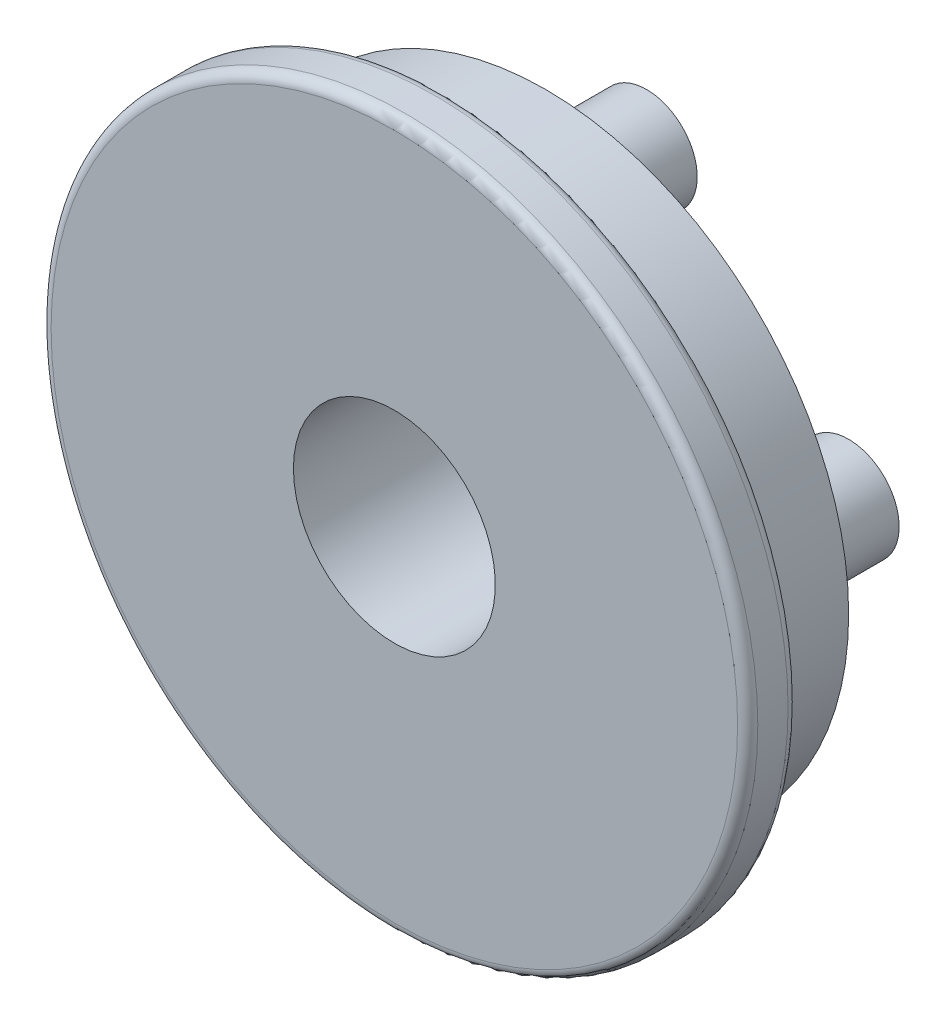
ISO-10303-21;
HEADER;
FILE_DESCRIPTION(('STEP AP214'),'2;1');
FILE_NAME('part.step','',(''),(''),'','','');
FILE_SCHEMA(('AUTOMOTIVE_DESIGN { 1 0 10303 214 1 1 1 1 }'));
ENDSEC;
DATA;
#1=APPLICATION_CONTEXT('core data for automotive mechanical design processes');
#2=APPLICATION_PROTOCOL_DEFINITION('international standard','automotive_design',2000,#1);
#3=PRODUCT_CONTEXT('',#1,'mechanical');
#4=PRODUCT('Part','Part','',(#3));
#5=PRODUCT_RELATED_PRODUCT_CATEGORY('part','',(#4));
#6=PRODUCT_DEFINITION_FORMATION('','',#4);
#7=PRODUCT_DEFINITION_CONTEXT('part definition',#1,'design');
#8=PRODUCT_DEFINITION('design','',#6,#7);
#9=PRODUCT_DEFINITION_SHAPE('','',#8);
#10=(LENGTH_UNIT() NAMED_UNIT(*) SI_UNIT(.MILLI.,.METRE.));
#11=(NAMED_UNIT(*) PLANE_ANGLE_UNIT() SI_UNIT($,.RADIAN.));
#12=(NAMED_UNIT(*) SI_UNIT($,.STERADIAN.) SOLID_ANGLE_UNIT());
#13=UNCERTAINTY_MEASURE_WITH_UNIT(LENGTH_MEASURE(1.E-05),#10,'distance_accuracy_value','');
#14=(GEOMETRIC_REPRESENTATION_CONTEXT(3) GLOBAL_UNCERTAINTY_ASSIGNED_CONTEXT((#13)) GLOBAL_UNIT_ASSIGNED_CONTEXT((#10,
#11,#12)) REPRESENTATION_CONTEXT('',''));
#15=CARTESIAN_POINT('',(0.,0.,0.));
#16=DIRECTION('',(0.,0.,1.));
#17=DIRECTION('',(1.,0.,0.));
#18=AXIS2_PLACEMENT_3D('',#15,#16,#17);
#19=CARTESIAN_POINT('',(0.,0.,5.));
#20=DIRECTION('',(0.,0.,-1.));
#21=DIRECTION('',(-1.,0.,0.));
#22=AXIS2_PLACEMENT_3D('',#19,#20,#21);
#23=CYLINDRICAL_SURFACE('',#22,35.);
#24=CARTESIAN_POINT('',(0.,0.,1.));
#25=DIRECTION('',(0.,0.,1.));
#26=DIRECTION('',(1.,0.,0.));
#27=AXIS2_PLACEMENT_3D('',#24,#25,#26);
#28=CIRCLE('',#27,35.);
#29=CARTESIAN_POINT('',(35.,0.,1.));
#30=VERTEX_POINT('',#29);
#31=EDGE_CURVE('E47',#30,#30,#28,.T.);
#32=ORIENTED_EDGE('',*,*,#31,.T.);
#33=EDGE_LOOP('',(#32));
#34=FACE_BOUND('',#33,.T.);
#35=CARTESIAN_POINT('',(0.,0.,4.));
#36=DIRECTION('',(0.,0.,1.));
#37=DIRECTION('',(1.,0.,0.));
#38=AXIS2_PLACEMENT_3D('',#35,#36,#37);
#39=CIRCLE('',#38,35.);
#40=CARTESIAN_POINT('',(35.,0.,4.));
#41=VERTEX_POINT('',#40);
#42=EDGE_CURVE('E52',#41,#41,#39,.F.);
#43=ORIENTED_EDGE('',*,*,#42,.T.);
#44=EDGE_LOOP('',(#43));
#45=FACE_BOUND('',#44,.T.);
#46=ADVANCED_FACE('F32',(#34,#45),#23,.T.);
#47=CARTESIAN_POINT('',(0.,0.,5.));
#48=DIRECTION('',(0.,0.,1.));
#49=DIRECTION('',(1.,0.,0.));
#50=AXIS2_PLACEMENT_3D('',#47,#48,#49);
#51=PLANE('',#50);
#52=CARTESIAN_POINT('',(0.,0.,5.));
#53=DIRECTION('',(0.,0.,-1.));
#54=DIRECTION('',(-1.,0.,0.));
#55=AXIS2_PLACEMENT_3D('',#52,#53,#54);
#56=CIRCLE('',#55,10.);
#57=CARTESIAN_POINT('',(-10.,0.,5.));
#58=VERTEX_POINT('',#57);
#59=EDGE_CURVE('E80',#58,#58,#56,.T.);
#60=ORIENTED_EDGE('',*,*,#59,.T.);
#61=EDGE_LOOP('',(#60));
#62=FACE_BOUND('',#61,.T.);
#63=CARTESIAN_POINT('',(0.,0.,5.));
#64=DIRECTION('',(0.,0.,1.));
#65=DIRECTION('',(1.,0.,0.));
#66=AXIS2_PLACEMENT_3D('',#63,#64,#65);
#67=CIRCLE('',#66,34.);
#68=CARTESIAN_POINT('',(34.,0.,5.));
#69=VERTEX_POINT('',#68);
#70=EDGE_CURVE('E39',#69,#69,#67,.T.);
#71=ORIENTED_EDGE('',*,*,#70,.T.);
#72=EDGE_LOOP('',(#71));
#73=FACE_BOUND('',#72,.T.);
#74=ADVANCED_FACE('F89',(#62,#73),#51,.T.);
#75=CARTESIAN_POINT('',(0.,0.,0.));
#76=DIRECTION('',(0.,0.,1.));
#77=DIRECTION('',(1.,0.,0.));
#78=AXIS2_PLACEMENT_3D('',#75,#76,#77);
#79=PLANE('',#78);
#80=CARTESIAN_POINT('',(0.,0.,0.));
#81=DIRECTION('',(0.,0.,1.));
#82=DIRECTION('',(1.,0.,0.));
#83=AXIS2_PLACEMENT_3D('',#80,#81,#82);
#84=CIRCLE('',#83,30.);
#85=CARTESIAN_POINT('',(30.,0.,0.));
#86=VERTEX_POINT('',#85);
#87=EDGE_CURVE('E10',#86,#86,#84,.F.);
#88=ORIENTED_EDGE('',*,*,#87,.F.);
#89=EDGE_LOOP('',(#88));
#90=FACE_BOUND('',#89,.T.);
#91=CARTESIAN_POINT('',(0.,0.,0.));
#92=DIRECTION('',(0.,0.,1.));
#93=DIRECTION('',(1.,0.,0.));
#94=AXIS2_PLACEMENT_3D('',#91,#92,#93);
#95=CIRCLE('',#94,34.);
#96=CARTESIAN_POINT('',(34.,0.,0.));
#97=VERTEX_POINT('',#96);
#98=EDGE_CURVE('E43',#97,#97,#95,.F.);
#99=ORIENTED_EDGE('',*,*,#98,.T.);
#100=EDGE_LOOP('',(#99));
#101=FACE_BOUND('',#100,.T.);
#102=ADVANCED_FACE('F128',(#90,#101),#79,.F.);
#103=CARTESIAN_POINT('',(0.,0.,1.));
#104=DIRECTION('',(0.,0.,1.));
#105=DIRECTION('',(1.,0.,0.));
#106=AXIS2_PLACEMENT_3D('',#103,#104,#105);
#107=TOROIDAL_SURFACE('',#106,34.,1.);
#108=ORIENTED_EDGE('',*,*,#98,.F.);
#109=EDGE_LOOP('',(#108));
#110=FACE_BOUND('',#109,.T.);
#111=ORIENTED_EDGE('',*,*,#31,.F.);
#112=EDGE_LOOP('',(#111));
#113=FACE_BOUND('',#112,.T.);
#114=ADVANCED_FACE('F119',(#110,#113),#107,.T.);
#115=CARTESIAN_POINT('',(0.,0.,4.));
#116=DIRECTION('',(0.,0.,1.));
#117=DIRECTION('',(1.,0.,0.));
#118=AXIS2_PLACEMENT_3D('',#115,#116,#117);
#119=TOROIDAL_SURFACE('',#118,34.,1.);
#120=ORIENTED_EDGE('',*,*,#42,.F.);
#121=EDGE_LOOP('',(#120));
#122=FACE_BOUND('',#121,.T.);
#123=ORIENTED_EDGE('',*,*,#70,.F.);
#124=EDGE_LOOP('',(#123));
#125=FACE_BOUND('',#124,.T.);
#126=ADVANCED_FACE('F34',(#122,#125),#119,.T.);
#127=CARTESIAN_POINT('',(0.,0.,-10.));
#128=DIRECTION('',(0.,0.,1.));
#129=DIRECTION('',(1.,0.,0.));
#130=AXIS2_PLACEMENT_3D('',#127,#128,#129);
#131=CYLINDRICAL_SURFACE('',#130,30.);
#132=CARTESIAN_POINT('',(0.,0.,-10.));
#133=DIRECTION('',(0.,0.,-1.));
#134=DIRECTION('',(-1.,0.,0.));
#135=AXIS2_PLACEMENT_3D('',#132,#133,#134);
#136=CIRCLE('',#135,30.);
#137=CARTESIAN_POINT('',(-30.,0.,-10.));
#138=VERTEX_POINT('',#137);
#139=EDGE_CURVE('E55',#138,#138,#136,.T.);
#140=ORIENTED_EDGE('',*,*,#139,.F.);
#141=EDGE_LOOP('',(#140));
#142=FACE_BOUND('',#141,.T.);
#143=ORIENTED_EDGE('',*,*,#87,.T.);
#144=EDGE_LOOP('',(#143));
#145=FACE_BOUND('',#144,.T.);
#146=ADVANCED_FACE('F102',(#142,#145),#131,.T.);
#147=CARTESIAN_POINT('',(0.,0.,-10.));
#148=DIRECTION('',(0.,0.,-1.));
#149=DIRECTION('',(-1.,0.,0.));
#150=AXIS2_PLACEMENT_3D('',#147,#148,#149);
#151=PLANE('',#150);
#152=CARTESIAN_POINT('',(0.,0.,-10.));
#153=DIRECTION('',(0.,0.,-1.));
#154=DIRECTION('',(-1.,0.,0.));
#155=AXIS2_PLACEMENT_3D('',#152,#153,#154);
#156=CIRCLE('',#155,10.);
#157=CARTESIAN_POINT('',(-10.,0.,-10.));
#158=VERTEX_POINT('',#157);
#159=EDGE_CURVE('E83',#158,#158,#156,.T.);
#160=ORIENTED_EDGE('',*,*,#159,.F.);
#161=EDGE_LOOP('',(#160));
#162=FACE_BOUND('',#161,.T.);
#163=CARTESIAN_POINT('',(19.9999999999994,-5.6843418860808E-13,-10.));
#164=DIRECTION('',(0.,0.,-1.));
#165=DIRECTION('',(-1.,0.,0.));
#166=AXIS2_PLACEMENT_3D('',#163,#164,#165);
#167=CIRCLE('',#166,5.00000000000091);
#168=CARTESIAN_POINT('',(14.9999999999985,-5.6843418860808E-13,-10.));
#169=VERTEX_POINT('',#168);
#170=EDGE_CURVE('E77',#169,#169,#167,.T.);
#171=ORIENTED_EDGE('',*,*,#170,.F.);
#172=EDGE_LOOP('',(#171));
#173=FACE_BOUND('',#172,.T.);
#174=CARTESIAN_POINT('',(-1.13196979001957E-12,-20.,-10.));
#175=DIRECTION('',(0.,0.,-1.));
#176=DIRECTION('',(-1.,0.,0.));
#177=AXIS2_PLACEMENT_3D('',#174,#175,#176);
#178=CIRCLE('',#177,5.00000000000122);
#179=CARTESIAN_POINT('',(-5.00000000000235,-20.,-10.));
#180=VERTEX_POINT('',#179);
#181=EDGE_CURVE('E71',#180,#180,#178,.T.);
#182=ORIENTED_EDGE('',*,*,#181,.F.);
#183=EDGE_LOOP('',(#182));
#184=FACE_BOUND('',#183,.T.);
#185=CARTESIAN_POINT('',(-20.0000000000006,5.65984895009786E-13,-10.));
#186=DIRECTION('',(0.,0.,-1.));
#187=DIRECTION('',(-1.,0.,0.));
#188=AXIS2_PLACEMENT_3D('',#185,#186,#187);
#189=CIRCLE('',#188,5.00000000000044);
#190=CARTESIAN_POINT('',(-25.000000000001,5.65984895009786E-13,-10.));
#191=VERTEX_POINT('',#190);
#192=EDGE_CURVE('E65',#191,#191,#189,.T.);
#193=ORIENTED_EDGE('',*,*,#192,.F.);
#194=EDGE_LOOP('',(#193));
#195=FACE_BOUND('',#194,.T.);
#196=CARTESIAN_POINT('',(0.,20.,-10.));
#197=DIRECTION('',(0.,0.,-1.));
#198=DIRECTION('',(-1.,0.,0.));
#199=AXIS2_PLACEMENT_3D('',#196,#197,#198);
#200=CIRCLE('',#199,5.);
#201=CARTESIAN_POINT('',(-5.,20.,-10.));
#202=VERTEX_POINT('',#201);
#203=EDGE_CURVE('E59',#202,#202,#200,.T.);
#204=ORIENTED_EDGE('',*,*,#203,.F.);
#205=EDGE_LOOP('',(#204));
#206=FACE_BOUND('',#205,.T.);
#207=ORIENTED_EDGE('',*,*,#139,.T.);
#208=EDGE_LOOP('',(#207));
#209=FACE_BOUND('',#208,.T.);
#210=ADVANCED_FACE('F98',(#162,#173,#184,#195,#206,#209),#151,.T.);
#211=CARTESIAN_POINT('',(0.,20.,-20.));
#212=DIRECTION('',(0.,0.,1.));
#213=DIRECTION('',(1.,0.,0.));
#214=AXIS2_PLACEMENT_3D('',#211,#212,#213);
#215=CYLINDRICAL_SURFACE('',#214,5.);
#216=CARTESIAN_POINT('',(0.,20.,-20.));
#217=DIRECTION('',(0.,0.,-1.));
#218=DIRECTION('',(-1.,0.,0.));
#219=AXIS2_PLACEMENT_3D('',#216,#217,#218);
#220=CIRCLE('',#219,5.);
#221=CARTESIAN_POINT('',(-5.,20.,-20.));
#222=VERTEX_POINT('',#221);
#223=EDGE_CURVE('E58',#222,#222,#220,.T.);
#224=ORIENTED_EDGE('',*,*,#223,.F.);
#225=EDGE_LOOP('',(#224));
#226=FACE_BOUND('',#225,.T.);
#227=ORIENTED_EDGE('',*,*,#203,.T.);
#228=EDGE_LOOP('',(#227));
#229=FACE_BOUND('',#228,.T.);
#230=ADVANCED_FACE('F101',(#226,#229),#215,.T.);
#231=CARTESIAN_POINT('',(0.,20.,-20.));
#232=DIRECTION('',(0.,0.,-1.));
#233=DIRECTION('',(-1.,0.,0.));
#234=AXIS2_PLACEMENT_3D('',#231,#232,#233);
#235=PLANE('',#234);
#236=ORIENTED_EDGE('',*,*,#223,.T.);
#237=EDGE_LOOP('',(#236));
#238=FACE_BOUND('',#237,.T.);
#239=ADVANCED_FACE('F212',(#238),#235,.T.);
#240=CARTESIAN_POINT('',(-20.0000000000006,5.65984895009786E-13,-20.));
#241=DIRECTION('',(0.,0.,1.));
#242=DIRECTION('',(1.,0.,0.));
#243=AXIS2_PLACEMENT_3D('',#240,#241,#242);
#244=CYLINDRICAL_SURFACE('',#243,5.00000000000044);
#245=CARTESIAN_POINT('',(-20.0000000000006,5.65984895009786E-13,-20.));
#246=DIRECTION('',(0.,0.,-1.));
#247=DIRECTION('',(-1.,0.,0.));
#248=AXIS2_PLACEMENT_3D('',#245,#246,#247);
#249=CIRCLE('',#248,5.00000000000044);
#250=CARTESIAN_POINT('',(-25.000000000001,5.65984895009786E-13,-20.));
#251=VERTEX_POINT('',#250);
#252=EDGE_CURVE('E62',#251,#251,#249,.T.);
#253=ORIENTED_EDGE('',*,*,#252,.F.);
#254=EDGE_LOOP('',(#253));
#255=FACE_BOUND('',#254,.T.);
#256=ORIENTED_EDGE('',*,*,#192,.T.);
#257=EDGE_LOOP('',(#256));
#258=FACE_BOUND('',#257,.T.);
#259=ADVANCED_FACE('F204',(#255,#258),#244,.T.);
#260=CARTESIAN_POINT('',(-20.0000000000006,5.65984895009786E-13,-20.));
#261=DIRECTION('',(0.,0.,-1.));
#262=DIRECTION('',(-1.,0.,0.));
#263=AXIS2_PLACEMENT_3D('',#260,#261,#262);
#264=PLANE('',#263);
#265=ORIENTED_EDGE('',*,*,#252,.T.);
#266=EDGE_LOOP('',(#265));
#267=FACE_BOUND('',#266,.T.);
#268=ADVANCED_FACE('F196',(#267),#264,.T.);
#269=CARTESIAN_POINT('',(-1.13196979001957E-12,-20.,-20.));
#270=DIRECTION('',(0.,0.,1.));
#271=DIRECTION('',(1.,0.,0.));
#272=AXIS2_PLACEMENT_3D('',#269,#270,#271);
#273=CYLINDRICAL_SURFACE('',#272,5.00000000000122);
#274=CARTESIAN_POINT('',(-1.13196979001957E-12,-20.,-20.));
#275=DIRECTION('',(0.,0.,-1.));
#276=DIRECTION('',(-1.,0.,0.));
#277=AXIS2_PLACEMENT_3D('',#274,#275,#276);
#278=CIRCLE('',#277,5.00000000000122);
#279=CARTESIAN_POINT('',(-5.00000000000235,-20.,-20.));
#280=VERTEX_POINT('',#279);
#281=EDGE_CURVE('E68',#280,#280,#278,.T.);
#282=ORIENTED_EDGE('',*,*,#281,.F.);
#283=EDGE_LOOP('',(#282));
#284=FACE_BOUND('',#283,.T.);
#285=ORIENTED_EDGE('',*,*,#181,.T.);
#286=EDGE_LOOP('',(#285));
#287=FACE_BOUND('',#286,.T.);
#288=ADVANCED_FACE('F188',(#284,#287),#273,.T.);
#289=CARTESIAN_POINT('',(-1.13196979001957E-12,-20.,-20.));
#290=DIRECTION('',(0.,0.,-1.));
#291=DIRECTION('',(-1.,0.,0.));
#292=AXIS2_PLACEMENT_3D('',#289,#290,#291);
#293=PLANE('',#292);
#294=ORIENTED_EDGE('',*,*,#281,.T.);
#295=EDGE_LOOP('',(#294));
#296=FACE_BOUND('',#295,.T.);
#297=ADVANCED_FACE('F180',(#296),#293,.T.);
#298=CARTESIAN_POINT('',(19.9999999999994,-5.6843418860808E-13,-20.));
#299=DIRECTION('',(0.,0.,1.));
#300=DIRECTION('',(1.,0.,0.));
#301=AXIS2_PLACEMENT_3D('',#298,#299,#300);
#302=CYLINDRICAL_SURFACE('',#301,5.00000000000091);
#303=CARTESIAN_POINT('',(19.9999999999994,-5.6843418860808E-13,-20.));
#304=DIRECTION('',(0.,0.,-1.));
#305=DIRECTION('',(-1.,0.,0.));
#306=AXIS2_PLACEMENT_3D('',#303,#304,#305);
#307=CIRCLE('',#306,5.00000000000091);
#308=CARTESIAN_POINT('',(14.9999999999985,-5.6843418860808E-13,-20.));
#309=VERTEX_POINT('',#308);
#310=EDGE_CURVE('E74',#309,#309,#307,.T.);
#311=ORIENTED_EDGE('',*,*,#310,.F.);
#312=EDGE_LOOP('',(#311));
#313=FACE_BOUND('',#312,.T.);
#314=ORIENTED_EDGE('',*,*,#170,.T.);
#315=EDGE_LOOP('',(#314));
#316=FACE_BOUND('',#315,.T.);
#317=ADVANCED_FACE('F175',(#313,#316),#302,.T.);
#318=CARTESIAN_POINT('',(19.9999999999994,-5.6843418860808E-13,-20.));
#319=DIRECTION('',(0.,0.,-1.));
#320=DIRECTION('',(-1.,0.,0.));
#321=AXIS2_PLACEMENT_3D('',#318,#319,#320);
#322=PLANE('',#321);
#323=ORIENTED_EDGE('',*,*,#310,.T.);
#324=EDGE_LOOP('',(#323));
#325=FACE_BOUND('',#324,.T.);
#326=ADVANCED_FACE('F94',(#325),#322,.T.);
#327=CARTESIAN_POINT('',(0.,0.,5.));
#328=DIRECTION('',(0.,0.,-1.));
#329=DIRECTION('',(-1.,0.,0.));
#330=AXIS2_PLACEMENT_3D('',#327,#328,#329);
#331=CYLINDRICAL_SURFACE('',#330,10.);
#332=ORIENTED_EDGE('',*,*,#59,.F.);
#333=EDGE_LOOP('',(#332));
#334=FACE_BOUND('',#333,.T.);
#335=ORIENTED_EDGE('',*,*,#159,.T.);
#336=EDGE_LOOP('',(#335));
#337=FACE_BOUND('',#336,.T.);
#338=ADVANCED_FACE('F91',(#334,#337),#331,.F.);
#339=CLOSED_SHELL('',(#46,#74,#102,#114,#126,#146,#210,#230,#239,#259,#268,#288,#297,#317,#326,#338));
#340=MANIFOLD_SOLID_BREP('B2',#339);
#341=ADVANCED_BREP_SHAPE_REPRESENTATION('',(#18,#340),#14);
#342=SHAPE_DEFINITION_REPRESENTATION(#9,#341);
ENDSEC;
END-ISO-10303-21;
